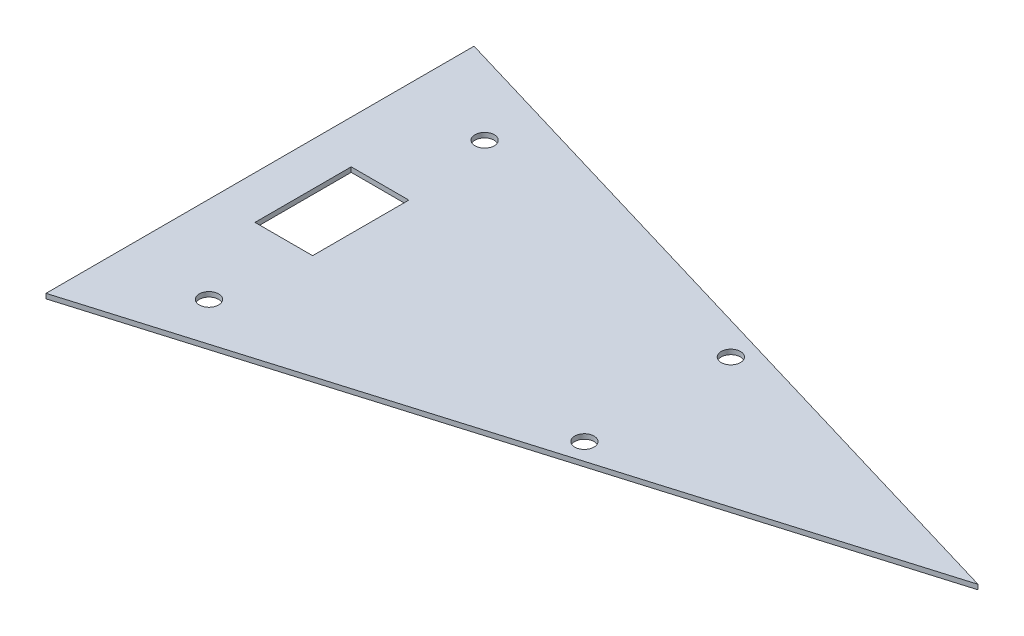
ISO-10303-21;
HEADER;
FILE_DESCRIPTION(('STEP AP214'),'2;1');
FILE_NAME('part.step','',(''),(''),'','','');
FILE_SCHEMA(('AUTOMOTIVE_DESIGN { 1 0 10303 214 1 1 1 1 }'));
ENDSEC;
DATA;
#1=APPLICATION_CONTEXT('core data for automotive mechanical design processes');
#2=APPLICATION_PROTOCOL_DEFINITION('international standard','automotive_design',2000,#1);
#3=PRODUCT_CONTEXT('',#1,'mechanical');
#4=PRODUCT('Part','Part','',(#3));
#5=PRODUCT_RELATED_PRODUCT_CATEGORY('part','',(#4));
#6=PRODUCT_DEFINITION_FORMATION('','',#4);
#7=PRODUCT_DEFINITION_CONTEXT('part definition',#1,'design');
#8=PRODUCT_DEFINITION('design','',#6,#7);
#9=PRODUCT_DEFINITION_SHAPE('','',#8);
#10=(LENGTH_UNIT() NAMED_UNIT(*) SI_UNIT(.MILLI.,.METRE.));
#11=(NAMED_UNIT(*) PLANE_ANGLE_UNIT() SI_UNIT($,.RADIAN.));
#12=(NAMED_UNIT(*) SI_UNIT($,.STERADIAN.) SOLID_ANGLE_UNIT());
#13=UNCERTAINTY_MEASURE_WITH_UNIT(LENGTH_MEASURE(1.E-05),#10,'distance_accuracy_value','');
#14=(GEOMETRIC_REPRESENTATION_CONTEXT(3) GLOBAL_UNCERTAINTY_ASSIGNED_CONTEXT((#13)) GLOBAL_UNIT_ASSIGNED_CONTEXT((#10,
#11,#12)) REPRESENTATION_CONTEXT('',''));
#15=CARTESIAN_POINT('',(0.,0.,0.));
#16=DIRECTION('',(0.,0.,1.));
#17=DIRECTION('',(1.,0.,0.));
#18=AXIS2_PLACEMENT_3D('',#15,#16,#17);
#19=CARTESIAN_POINT('',(-112.290148161878,-89.048645980018,-133.312365232721));
#20=DIRECTION('',(0.,1.,0.));
#21=DIRECTION('',(0.,0.,1.));
#22=AXIS2_PLACEMENT_3D('',#19,#20,#21);
#23=PLANE('',#22);
#24=CARTESIAN_POINT('',(135.362738012916,-89.048645980018,45.6189492870768));
#25=DIRECTION('',(0.,1.,0.));
#26=DIRECTION('',(0.,0.,1.));
#27=AXIS2_PLACEMENT_3D('',#24,#25,#26);
#28=CIRCLE('',#27,6.00000000000002);
#29=CARTESIAN_POINT('',(135.362738012916,-89.048645980018,51.6189492870768));
#30=VERTEX_POINT('',#29);
#31=EDGE_CURVE('E39',#30,#30,#28,.F.);
#32=ORIENTED_EDGE('',*,*,#31,.T.);
#33=EDGE_LOOP('',(#32));
#34=FACE_BOUND('',#33,.T.);
#35=DIRECTION('',(-1.,0.,0.));
#36=VECTOR('',#35,1.);
#37=CARTESIAN_POINT('',(-49.5564619228837,-89.048645980018,-29.9726103991469));
#38=LINE('',#37,#36);
#39=CARTESIAN_POINT('',(-49.5564619228837,-89.048645980018,-29.9726103991469));
#40=VERTEX_POINT('',#39);
#41=CARTESIAN_POINT('',(-85.4621718677283,-89.048645980018,-29.9726103991469));
#42=VERTEX_POINT('',#41);
#43=EDGE_CURVE('E108',#40,#42,#38,.T.);
#44=ORIENTED_EDGE('',*,*,#43,.F.);
#45=DIRECTION('',(0.,0.,-1.));
#46=VECTOR('',#45,1.);
#47=CARTESIAN_POINT('',(-49.5564619228837,-89.048645980018,29.9726103991469));
#48=LINE('',#47,#46);
#49=CARTESIAN_POINT('',(-49.5564619228837,-89.048645980018,29.9726103991469));
#50=VERTEX_POINT('',#49);
#51=EDGE_CURVE('E102',#50,#40,#48,.T.);
#52=ORIENTED_EDGE('',*,*,#51,.F.);
#53=DIRECTION('',(-1.,0.,0.));
#54=VECTOR('',#53,1.);
#55=CARTESIAN_POINT('',(-49.5564619228837,-89.048645980018,29.9726103991469));
#56=LINE('',#55,#54);
#57=CARTESIAN_POINT('',(-85.4621718677283,-89.048645980018,29.9726103991469));
#58=VERTEX_POINT('',#57);
#59=EDGE_CURVE('E120',#50,#58,#56,.T.);
#60=ORIENTED_EDGE('',*,*,#59,.T.);
#61=DIRECTION('',(0.,0.,-1.));
#62=VECTOR('',#61,1.);
#63=CARTESIAN_POINT('',(-85.4621718677283,-89.048645980018,29.9726103991469));
#64=LINE('',#63,#62);
#65=EDGE_CURVE('E118',#58,#42,#64,.T.);
#66=ORIENTED_EDGE('',*,*,#65,.T.);
#67=EDGE_LOOP('',(#44,#52,#60,#66));
#68=FACE_BOUND('',#67,.T.);
#69=DIRECTION('',(-0.958330009522806,0.,-0.285663425814398));
#70=VECTOR('',#69,1.);
#71=CARTESIAN_POINT('',(-112.290148161878,-89.048645980018,-133.312365232721));
#72=LINE('',#71,#70);
#73=CARTESIAN_POINT('',(334.939803935624,-89.048645980018,0.));
#74=VERTEX_POINT('',#73);
#75=CARTESIAN_POINT('',(-112.290148161878,-89.048645980018,-133.312365232721));
#76=VERTEX_POINT('',#75);
#77=EDGE_CURVE('E222',#74,#76,#72,.T.);
#78=ORIENTED_EDGE('',*,*,#77,.T.);
#79=DIRECTION('',(0.,0.,1.));
#80=VECTOR('',#79,1.);
#81=CARTESIAN_POINT('',(-112.290148161878,-89.048645980018,-133.312365232721));
#82=LINE('',#81,#80);
#83=CARTESIAN_POINT('',(-112.290148161878,-89.048645980018,133.312365232721));
#84=VERTEX_POINT('',#83);
#85=EDGE_CURVE('E219',#76,#84,#82,.T.);
#86=ORIENTED_EDGE('',*,*,#85,.T.);
#87=DIRECTION('',(0.958330009522806,0.,-0.285663425814398));
#88=VECTOR('',#87,1.);
#89=CARTESIAN_POINT('',(334.939803935624,-89.048645980018,0.));
#90=LINE('',#89,#88);
#91=EDGE_CURVE('E217',#84,#74,#90,.T.);
#92=ORIENTED_EDGE('',*,*,#91,.T.);
#93=EDGE_LOOP('',(#78,#86,#92));
#94=FACE_BOUND('',#93,.T.);
#95=CARTESIAN_POINT('',(135.362738012916,-89.048645980018,-45.6189492870767));
#96=DIRECTION('',(0.,1.,0.));
#97=DIRECTION('',(0.,0.,1.));
#98=AXIS2_PLACEMENT_3D('',#95,#96,#97);
#99=CIRCLE('',#98,6.00000000000002);
#100=CARTESIAN_POINT('',(135.362738012916,-89.048645980018,-39.6189492870767));
#101=VERTEX_POINT('',#100);
#102=EDGE_CURVE('E141',#101,#101,#99,.F.);
#103=ORIENTED_EDGE('',*,*,#102,.T.);
#104=EDGE_LOOP('',(#103));
#105=FACE_BOUND('',#104,.T.);
#106=CARTESIAN_POINT('',(-58.2462225099883,-89.048645980018,85.8550517230122));
#107=DIRECTION('',(0.,1.,0.));
#108=DIRECTION('',(0.,0.,1.));
#109=AXIS2_PLACEMENT_3D('',#106,#107,#108);
#110=CIRCLE('',#109,6.);
#111=CARTESIAN_POINT('',(-58.2462225099883,-89.048645980018,91.8550517230122));
#112=VERTEX_POINT('',#111);
#113=EDGE_CURVE('E137',#112,#112,#110,.F.);
#114=ORIENTED_EDGE('',*,*,#113,.T.);
#115=EDGE_LOOP('',(#114));
#116=FACE_BOUND('',#115,.T.);
#117=CARTESIAN_POINT('',(-58.2462225099883,-89.048645980018,-85.8550517230122));
#118=DIRECTION('',(0.,1.,0.));
#119=DIRECTION('',(0.,0.,1.));
#120=AXIS2_PLACEMENT_3D('',#117,#118,#119);
#121=CIRCLE('',#120,6.);
#122=CARTESIAN_POINT('',(-58.2462225099883,-89.048645980018,-79.8550517230122));
#123=VERTEX_POINT('',#122);
#124=EDGE_CURVE('E143',#123,#123,#121,.F.);
#125=ORIENTED_EDGE('',*,*,#124,.T.);
#126=EDGE_LOOP('',(#125));
#127=FACE_BOUND('',#126,.T.);
#128=ADVANCED_FACE('F36',(#34,#68,#94,#105,#116,#127),#23,.T.);
#129=CARTESIAN_POINT('',(-49.5564619228837,-92.048645980018,29.9726103991469));
#130=DIRECTION('',(1.,0.,0.));
#131=DIRECTION('',(0.,0.,-1.));
#132=AXIS2_PLACEMENT_3D('',#129,#130,#131);
#133=PLANE('',#132);
#134=ORIENTED_EDGE('',*,*,#51,.T.);
#135=DIRECTION('',(0.,1.,0.));
#136=VECTOR('',#135,1.);
#137=CARTESIAN_POINT('',(-49.5564619228837,-92.048645980018,-29.9726103991469));
#138=LINE('',#137,#136);
#139=CARTESIAN_POINT('',(-49.5564619228837,-92.048645980018,-29.9726103991469));
#140=VERTEX_POINT('',#139);
#141=EDGE_CURVE('E75',#140,#40,#138,.T.);
#142=ORIENTED_EDGE('',*,*,#141,.F.);
#143=DIRECTION('',(0.,0.,-1.));
#144=VECTOR('',#143,1.);
#145=CARTESIAN_POINT('',(-49.5564619228837,-92.048645980018,29.9726103991469));
#146=LINE('',#145,#144);
#147=CARTESIAN_POINT('',(-49.5564619228837,-92.048645980018,29.9726103991469));
#148=VERTEX_POINT('',#147);
#149=EDGE_CURVE('E128',#148,#140,#146,.T.);
#150=ORIENTED_EDGE('',*,*,#149,.F.);
#151=DIRECTION('',(0.,1.,0.));
#152=VECTOR('',#151,1.);
#153=CARTESIAN_POINT('',(-49.5564619228837,-92.048645980018,29.9726103991469));
#154=LINE('',#153,#152);
#155=EDGE_CURVE('E78',#148,#50,#154,.T.);
#156=ORIENTED_EDGE('',*,*,#155,.T.);
#157=EDGE_LOOP('',(#134,#142,#150,#156));
#158=FACE_BOUND('',#157,.T.);
#159=ADVANCED_FACE('F103',(#158),#133,.F.);
#160=CARTESIAN_POINT('',(-49.5564619228837,-92.048645980018,-29.9726103991469));
#161=DIRECTION('',(0.,0.,-1.));
#162=DIRECTION('',(-1.,0.,0.));
#163=AXIS2_PLACEMENT_3D('',#160,#161,#162);
#164=PLANE('',#163);
#165=ORIENTED_EDGE('',*,*,#43,.T.);
#166=DIRECTION('',(0.,1.,0.));
#167=VECTOR('',#166,1.);
#168=CARTESIAN_POINT('',(-85.4621718677283,-92.048645980018,-29.9726103991469));
#169=LINE('',#168,#167);
#170=CARTESIAN_POINT('',(-85.4621718677283,-92.048645980018,-29.9726103991469));
#171=VERTEX_POINT('',#170);
#172=EDGE_CURVE('E54',#171,#42,#169,.T.);
#173=ORIENTED_EDGE('',*,*,#172,.F.);
#174=DIRECTION('',(-1.,0.,0.));
#175=VECTOR('',#174,1.);
#176=CARTESIAN_POINT('',(-49.5564619228837,-92.048645980018,-29.9726103991469));
#177=LINE('',#176,#175);
#178=EDGE_CURVE('E114',#140,#171,#177,.T.);
#179=ORIENTED_EDGE('',*,*,#178,.F.);
#180=ORIENTED_EDGE('',*,*,#141,.T.);
#181=EDGE_LOOP('',(#165,#173,#179,#180));
#182=FACE_BOUND('',#181,.T.);
#183=ADVANCED_FACE('F111',(#182),#164,.F.);
#184=CARTESIAN_POINT('',(-112.290148161878,-89.048645980018,-133.312365232721));
#185=DIRECTION('',(1.,0.,0.));
#186=DIRECTION('',(0.,0.,-1.));
#187=AXIS2_PLACEMENT_3D('',#184,#185,#186);
#188=PLANE('',#187);
#189=DIRECTION('',(0.,0.,1.));
#190=VECTOR('',#189,1.);
#191=CARTESIAN_POINT('',(-112.290148161878,-92.048645980018,-133.312365232721));
#192=LINE('',#191,#190);
#193=CARTESIAN_POINT('',(-112.290148161878,-92.048645980018,-133.312365232721));
#194=VERTEX_POINT('',#193);
#195=CARTESIAN_POINT('',(-112.290148161878,-92.048645980018,133.312365232721));
#196=VERTEX_POINT('',#195);
#197=EDGE_CURVE('E206',#194,#196,#192,.T.);
#198=ORIENTED_EDGE('',*,*,#197,.T.);
#199=DIRECTION('',(0.,-1.,0.));
#200=VECTOR('',#199,1.);
#201=CARTESIAN_POINT('',(-112.290148161878,-89.048645980018,133.312365232721));
#202=LINE('',#201,#200);
#203=EDGE_CURVE('E232',#84,#196,#202,.T.);
#204=ORIENTED_EDGE('',*,*,#203,.F.);
#205=ORIENTED_EDGE('',*,*,#85,.F.);
#206=DIRECTION('',(0.,-1.,0.));
#207=VECTOR('',#206,1.);
#208=CARTESIAN_POINT('',(-112.290148161878,-89.048645980018,-133.312365232721));
#209=LINE('',#208,#207);
#210=EDGE_CURVE('E140',#76,#194,#209,.T.);
#211=ORIENTED_EDGE('',*,*,#210,.T.);
#212=EDGE_LOOP('',(#198,#204,#205,#211));
#213=FACE_BOUND('',#212,.T.);
#214=ADVANCED_FACE('F174',(#213),#188,.F.);
#215=CARTESIAN_POINT('',(-112.290148161878,-89.048645980018,-133.312365232721));
#216=DIRECTION('',(-0.285663425814398,0.,0.958330009522806));
#217=DIRECTION('',(0.958330009522806,0.,0.285663425814398));
#218=AXIS2_PLACEMENT_3D('',#215,#216,#217);
#219=PLANE('',#218);
#220=DIRECTION('',(-0.958330009522806,0.,-0.285663425814398));
#221=VECTOR('',#220,1.);
#222=CARTESIAN_POINT('',(-112.290148161878,-92.048645980018,-133.312365232721));
#223=LINE('',#222,#221);
#224=CARTESIAN_POINT('',(334.939803935624,-92.048645980018,0.));
#225=VERTEX_POINT('',#224);
#226=EDGE_CURVE('E204',#225,#194,#223,.T.);
#227=ORIENTED_EDGE('',*,*,#226,.T.);
#228=ORIENTED_EDGE('',*,*,#210,.F.);
#229=ORIENTED_EDGE('',*,*,#77,.F.);
#230=DIRECTION('',(0.,-1.,0.));
#231=VECTOR('',#230,1.);
#232=CARTESIAN_POINT('',(334.939803935624,-89.048645980018,0.));
#233=LINE('',#232,#231);
#234=EDGE_CURVE('E220',#74,#225,#233,.T.);
#235=ORIENTED_EDGE('',*,*,#234,.T.);
#236=EDGE_LOOP('',(#227,#228,#229,#235));
#237=FACE_BOUND('',#236,.T.);
#238=ADVANCED_FACE('F192',(#237),#219,.F.);
#239=CARTESIAN_POINT('',(0.,-92.048645980018,0.));
#240=DIRECTION('',(0.,-1.,0.));
#241=DIRECTION('',(0.,0.,-1.));
#242=AXIS2_PLACEMENT_3D('',#239,#240,#241);
#243=PLANE('',#242);
#244=CARTESIAN_POINT('',(135.362738012916,-92.048645980018,-45.6189492870767));
#245=DIRECTION('',(0.,1.,0.));
#246=DIRECTION('',(0.,0.,1.));
#247=AXIS2_PLACEMENT_3D('',#244,#245,#246);
#248=CIRCLE('',#247,6.00000000000002);
#249=CARTESIAN_POINT('',(135.362738012916,-92.048645980018,-39.6189492870767));
#250=VERTEX_POINT('',#249);
#251=EDGE_CURVE('E11',#250,#250,#248,.T.);
#252=ORIENTED_EDGE('',*,*,#251,.T.);
#253=EDGE_LOOP('',(#252));
#254=FACE_BOUND('',#253,.T.);
#255=CARTESIAN_POINT('',(135.362738012916,-92.048645980018,45.6189492870768));
#256=DIRECTION('',(0.,1.,0.));
#257=DIRECTION('',(0.,0.,1.));
#258=AXIS2_PLACEMENT_3D('',#255,#256,#257);
#259=CIRCLE('',#258,6.00000000000002);
#260=CARTESIAN_POINT('',(135.362738012916,-92.048645980018,51.6189492870768));
#261=VERTEX_POINT('',#260);
#262=EDGE_CURVE('E45',#261,#261,#259,.T.);
#263=ORIENTED_EDGE('',*,*,#262,.T.);
#264=EDGE_LOOP('',(#263));
#265=FACE_BOUND('',#264,.T.);
#266=CARTESIAN_POINT('',(-58.2462225099883,-92.048645980018,-85.8550517230122));
#267=DIRECTION('',(0.,1.,0.));
#268=DIRECTION('',(0.,0.,1.));
#269=AXIS2_PLACEMENT_3D('',#266,#267,#268);
#270=CIRCLE('',#269,6.);
#271=CARTESIAN_POINT('',(-58.2462225099883,-92.048645980018,-79.8550517230122));
#272=VERTEX_POINT('',#271);
#273=EDGE_CURVE('E132',#272,#272,#270,.T.);
#274=ORIENTED_EDGE('',*,*,#273,.T.);
#275=EDGE_LOOP('',(#274));
#276=FACE_BOUND('',#275,.T.);
#277=CARTESIAN_POINT('',(-58.2462225099883,-92.048645980018,85.8550517230122));
#278=DIRECTION('',(0.,1.,0.));
#279=DIRECTION('',(0.,0.,1.));
#280=AXIS2_PLACEMENT_3D('',#277,#278,#279);
#281=CIRCLE('',#280,6.);
#282=CARTESIAN_POINT('',(-58.2462225099883,-92.048645980018,91.8550517230122));
#283=VERTEX_POINT('',#282);
#284=EDGE_CURVE('E107',#283,#283,#281,.T.);
#285=ORIENTED_EDGE('',*,*,#284,.T.);
#286=EDGE_LOOP('',(#285));
#287=FACE_BOUND('',#286,.T.);
#288=ORIENTED_EDGE('',*,*,#149,.T.);
#289=ORIENTED_EDGE('',*,*,#178,.T.);
#290=DIRECTION('',(0.,0.,-1.));
#291=VECTOR('',#290,1.);
#292=CARTESIAN_POINT('',(-85.4621718677283,-92.048645980018,29.9726103991469));
#293=LINE('',#292,#291);
#294=CARTESIAN_POINT('',(-85.4621718677283,-92.048645980018,29.9726103991469));
#295=VERTEX_POINT('',#294);
#296=EDGE_CURVE('E125',#295,#171,#293,.T.);
#297=ORIENTED_EDGE('',*,*,#296,.F.);
#298=DIRECTION('',(-1.,0.,0.));
#299=VECTOR('',#298,1.);
#300=CARTESIAN_POINT('',(-49.5564619228837,-92.048645980018,29.9726103991469));
#301=LINE('',#300,#299);
#302=EDGE_CURVE('E68',#148,#295,#301,.T.);
#303=ORIENTED_EDGE('',*,*,#302,.F.);
#304=EDGE_LOOP('',(#288,#289,#297,#303));
#305=FACE_BOUND('',#304,.T.);
#306=ORIENTED_EDGE('',*,*,#226,.F.);
#307=DIRECTION('',(0.958330009522806,0.,-0.285663425814398));
#308=VECTOR('',#307,1.);
#309=CARTESIAN_POINT('',(334.939803935624,-92.048645980018,0.));
#310=LINE('',#309,#308);
#311=EDGE_CURVE('E205',#196,#225,#310,.T.);
#312=ORIENTED_EDGE('',*,*,#311,.F.);
#313=ORIENTED_EDGE('',*,*,#197,.F.);
#314=EDGE_LOOP('',(#306,#312,#313));
#315=FACE_BOUND('',#314,.T.);
#316=ADVANCED_FACE('F178',(#254,#265,#276,#287,#305,#315),#243,.T.);
#317=CARTESIAN_POINT('',(-58.2462225099883,-92.048645980018,-85.8550517230122));
#318=DIRECTION('',(0.,1.,0.));
#319=DIRECTION('',(0.,0.,1.));
#320=AXIS2_PLACEMENT_3D('',#317,#318,#319);
#321=CYLINDRICAL_SURFACE('',#320,6.);
#322=ORIENTED_EDGE('',*,*,#273,.F.);
#323=EDGE_LOOP('',(#322));
#324=FACE_BOUND('',#323,.T.);
#325=ORIENTED_EDGE('',*,*,#124,.F.);
#326=EDGE_LOOP('',(#325));
#327=FACE_BOUND('',#326,.T.);
#328=ADVANCED_FACE('F185',(#324,#327),#321,.F.);
#329=CARTESIAN_POINT('',(-58.2462225099883,-92.048645980018,85.8550517230122));
#330=DIRECTION('',(0.,1.,0.));
#331=DIRECTION('',(0.,0.,1.));
#332=AXIS2_PLACEMENT_3D('',#329,#330,#331);
#333=CYLINDRICAL_SURFACE('',#332,6.);
#334=ORIENTED_EDGE('',*,*,#284,.F.);
#335=EDGE_LOOP('',(#334));
#336=FACE_BOUND('',#335,.T.);
#337=ORIENTED_EDGE('',*,*,#113,.F.);
#338=EDGE_LOOP('',(#337));
#339=FACE_BOUND('',#338,.T.);
#340=ADVANCED_FACE('F164',(#336,#339),#333,.F.);
#341=CARTESIAN_POINT('',(135.362738012916,-92.048645980018,-45.6189492870767));
#342=DIRECTION('',(0.,1.,0.));
#343=DIRECTION('',(0.,0.,1.));
#344=AXIS2_PLACEMENT_3D('',#341,#342,#343);
#345=CYLINDRICAL_SURFACE('',#344,6.00000000000002);
#346=ORIENTED_EDGE('',*,*,#251,.F.);
#347=EDGE_LOOP('',(#346));
#348=FACE_BOUND('',#347,.T.);
#349=ORIENTED_EDGE('',*,*,#102,.F.);
#350=EDGE_LOOP('',(#349));
#351=FACE_BOUND('',#350,.T.);
#352=ADVANCED_FACE('F154',(#348,#351),#345,.F.);
#353=CARTESIAN_POINT('',(135.362738012916,-92.048645980018,45.6189492870768));
#354=DIRECTION('',(0.,1.,0.));
#355=DIRECTION('',(0.,0.,1.));
#356=AXIS2_PLACEMENT_3D('',#353,#354,#355);
#357=CYLINDRICAL_SURFACE('',#356,6.00000000000002);
#358=ORIENTED_EDGE('',*,*,#262,.F.);
#359=EDGE_LOOP('',(#358));
#360=FACE_BOUND('',#359,.T.);
#361=ORIENTED_EDGE('',*,*,#31,.F.);
#362=EDGE_LOOP('',(#361));
#363=FACE_BOUND('',#362,.T.);
#364=ADVANCED_FACE('F151',(#360,#363),#357,.F.);
#365=CARTESIAN_POINT('',(334.939803935624,-89.048645980018,0.));
#366=DIRECTION('',(-0.285663425814398,0.,-0.958330009522806));
#367=DIRECTION('',(-0.958330009522806,0.,0.285663425814398));
#368=AXIS2_PLACEMENT_3D('',#365,#366,#367);
#369=PLANE('',#368);
#370=ORIENTED_EDGE('',*,*,#311,.T.);
#371=ORIENTED_EDGE('',*,*,#234,.F.);
#372=ORIENTED_EDGE('',*,*,#91,.F.);
#373=ORIENTED_EDGE('',*,*,#203,.T.);
#374=EDGE_LOOP('',(#370,#371,#372,#373));
#375=FACE_BOUND('',#374,.T.);
#376=ADVANCED_FACE('F153',(#375),#369,.F.);
#377=CARTESIAN_POINT('',(-49.5564619228837,-92.048645980018,29.9726103991469));
#378=DIRECTION('',(0.,0.,-1.));
#379=DIRECTION('',(-1.,0.,0.));
#380=AXIS2_PLACEMENT_3D('',#377,#378,#379);
#381=PLANE('',#380);
#382=ORIENTED_EDGE('',*,*,#59,.F.);
#383=ORIENTED_EDGE('',*,*,#155,.F.);
#384=ORIENTED_EDGE('',*,*,#302,.T.);
#385=DIRECTION('',(0.,1.,0.));
#386=VECTOR('',#385,1.);
#387=CARTESIAN_POINT('',(-85.4621718677283,-92.048645980018,29.9726103991469));
#388=LINE('',#387,#386);
#389=EDGE_CURVE('E212',#295,#58,#388,.T.);
#390=ORIENTED_EDGE('',*,*,#389,.T.);
#391=EDGE_LOOP('',(#382,#383,#384,#390));
#392=FACE_BOUND('',#391,.T.);
#393=ADVANCED_FACE('F161',(#392),#381,.T.);
#394=CARTESIAN_POINT('',(-85.4621718677283,-92.048645980018,29.9726103991469));
#395=DIRECTION('',(1.,0.,0.));
#396=DIRECTION('',(0.,0.,-1.));
#397=AXIS2_PLACEMENT_3D('',#394,#395,#396);
#398=PLANE('',#397);
#399=ORIENTED_EDGE('',*,*,#65,.F.);
#400=ORIENTED_EDGE('',*,*,#389,.F.);
#401=ORIENTED_EDGE('',*,*,#296,.T.);
#402=ORIENTED_EDGE('',*,*,#172,.T.);
#403=EDGE_LOOP('',(#399,#400,#401,#402));
#404=FACE_BOUND('',#403,.T.);
#405=ADVANCED_FACE('F176',(#404),#398,.T.);
#406=CLOSED_SHELL('',(#128,#159,#183,#214,#238,#316,#328,#340,#352,#364,#376,#393,#405));
#407=MANIFOLD_SOLID_BREP('B2',#406);
#408=ADVANCED_BREP_SHAPE_REPRESENTATION('',(#18,#407),#14);
#409=SHAPE_DEFINITION_REPRESENTATION(#9,#408);
ENDSEC;
END-ISO-10303-21;
